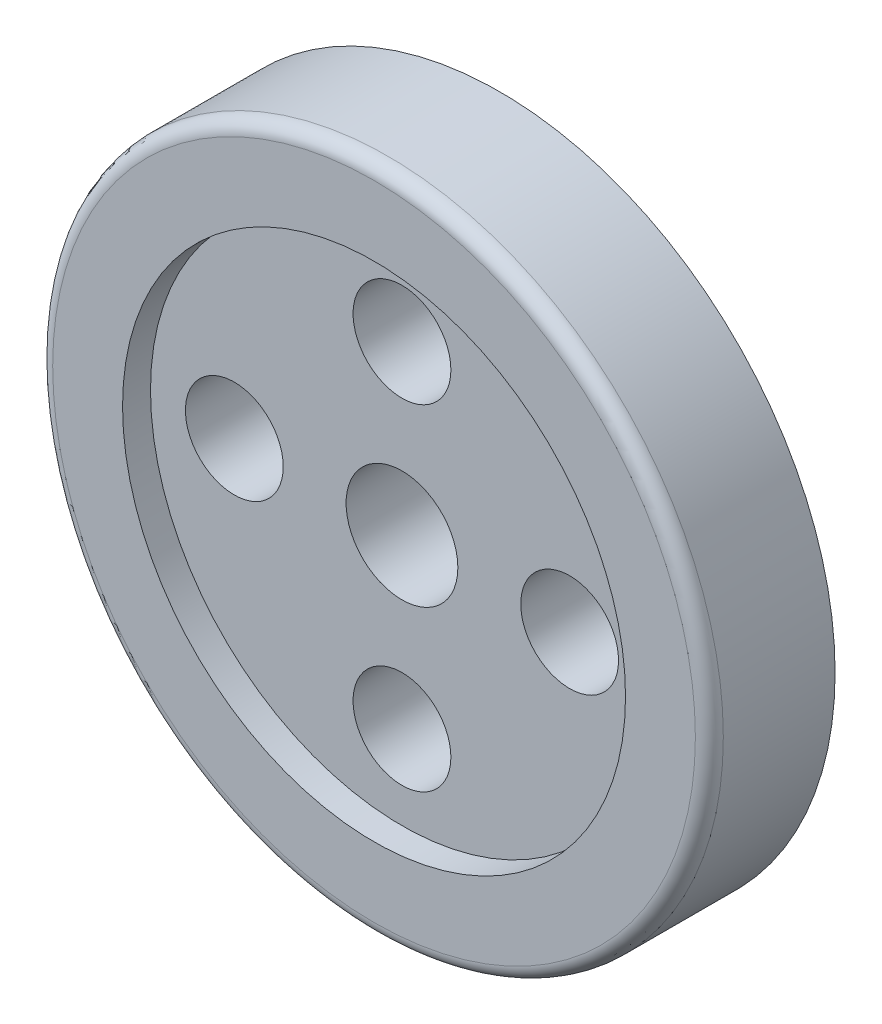
ISO-10303-21;
HEADER;
FILE_DESCRIPTION(('STEP AP214'),'2;1');
FILE_NAME('part.step','',(''),(''),'','','');
FILE_SCHEMA(('AUTOMOTIVE_DESIGN { 1 0 10303 214 1 1 1 1 }'));
ENDSEC;
DATA;
#1=APPLICATION_CONTEXT('core data for automotive mechanical design processes');
#2=APPLICATION_PROTOCOL_DEFINITION('international standard','automotive_design',2000,#1);
#3=PRODUCT_CONTEXT('',#1,'mechanical');
#4=PRODUCT('Part','Part','',(#3));
#5=PRODUCT_RELATED_PRODUCT_CATEGORY('part','',(#4));
#6=PRODUCT_DEFINITION_FORMATION('','',#4);
#7=PRODUCT_DEFINITION_CONTEXT('part definition',#1,'design');
#8=PRODUCT_DEFINITION('design','',#6,#7);
#9=PRODUCT_DEFINITION_SHAPE('','',#8);
#10=(LENGTH_UNIT() NAMED_UNIT(*) SI_UNIT(.MILLI.,.METRE.));
#11=(NAMED_UNIT(*) PLANE_ANGLE_UNIT() SI_UNIT($,.RADIAN.));
#12=(NAMED_UNIT(*) SI_UNIT($,.STERADIAN.) SOLID_ANGLE_UNIT());
#13=UNCERTAINTY_MEASURE_WITH_UNIT(LENGTH_MEASURE(1.E-05),#10,'distance_accuracy_value','');
#14=(GEOMETRIC_REPRESENTATION_CONTEXT(3) GLOBAL_UNCERTAINTY_ASSIGNED_CONTEXT((#13)) GLOBAL_UNIT_ASSIGNED_CONTEXT((#10,
#11,#12)) REPRESENTATION_CONTEXT('',''));
#15=CARTESIAN_POINT('',(0.,0.,0.));
#16=DIRECTION('',(0.,0.,1.));
#17=DIRECTION('',(1.,0.,0.));
#18=AXIS2_PLACEMENT_3D('',#15,#16,#17);
#19=CARTESIAN_POINT('',(0.,0.,4.5));
#20=DIRECTION('',(0.,0.,-1.));
#21=DIRECTION('',(-1.,0.,0.));
#22=AXIS2_PLACEMENT_3D('',#19,#20,#21);
#23=CYLINDRICAL_SURFACE('',#22,18.);
#24=CARTESIAN_POINT('',(0.,0.,2.5));
#25=DIRECTION('',(0.,0.,1.));
#26=DIRECTION('',(1.,0.,0.));
#27=AXIS2_PLACEMENT_3D('',#24,#25,#26);
#28=CIRCLE('',#27,18.);
#29=CARTESIAN_POINT('',(18.,0.,2.5));
#30=VERTEX_POINT('',#29);
#31=EDGE_CURVE('E43',#30,#30,#28,.T.);
#32=ORIENTED_EDGE('',*,*,#31,.F.);
#33=EDGE_LOOP('',(#32));
#34=FACE_BOUND('',#33,.T.);
#35=CARTESIAN_POINT('',(0.,0.,4.5));
#36=DIRECTION('',(0.,0.,1.));
#37=DIRECTION('',(1.,0.,0.));
#38=AXIS2_PLACEMENT_3D('',#35,#36,#37);
#39=CIRCLE('',#38,18.);
#40=CARTESIAN_POINT('',(18.,0.,4.5));
#41=VERTEX_POINT('',#40);
#42=EDGE_CURVE('E47',#41,#41,#39,.T.);
#43=ORIENTED_EDGE('',*,*,#42,.T.);
#44=EDGE_LOOP('',(#43));
#45=FACE_BOUND('',#44,.T.);
#46=ADVANCED_FACE('F32',(#34,#45),#23,.F.);
#47=CARTESIAN_POINT('',(0.,0.,4.5));
#48=DIRECTION('',(0.,0.,-1.));
#49=DIRECTION('',(-1.,0.,0.));
#50=AXIS2_PLACEMENT_3D('',#47,#48,#49);
#51=CYLINDRICAL_SURFACE('',#50,24.);
#52=CARTESIAN_POINT('',(0.,0.,3.5));
#53=DIRECTION('',(0.,0.,1.));
#54=DIRECTION('',(1.,0.,0.));
#55=AXIS2_PLACEMENT_3D('',#52,#53,#54);
#56=CIRCLE('',#55,24.);
#57=CARTESIAN_POINT('',(24.,0.,3.5));
#58=VERTEX_POINT('',#57);
#59=EDGE_CURVE('E10',#58,#58,#56,.F.);
#60=ORIENTED_EDGE('',*,*,#59,.T.);
#61=EDGE_LOOP('',(#60));
#62=FACE_BOUND('',#61,.T.);
#63=CARTESIAN_POINT('',(0.,0.,-4.5));
#64=DIRECTION('',(0.,0.,1.));
#65=DIRECTION('',(1.,0.,0.));
#66=AXIS2_PLACEMENT_3D('',#63,#64,#65);
#67=CIRCLE('',#66,24.);
#68=CARTESIAN_POINT('',(24.,0.,-4.5));
#69=VERTEX_POINT('',#68);
#70=EDGE_CURVE('E50',#69,#69,#67,.T.);
#71=ORIENTED_EDGE('',*,*,#70,.T.);
#72=EDGE_LOOP('',(#71));
#73=FACE_BOUND('',#72,.T.);
#74=ADVANCED_FACE('F118',(#62,#73),#51,.T.);
#75=CARTESIAN_POINT('',(0.,0.,4.5));
#76=DIRECTION('',(0.,0.,1.));
#77=DIRECTION('',(1.,0.,0.));
#78=AXIS2_PLACEMENT_3D('',#75,#76,#77);
#79=PLANE('',#78);
#80=CARTESIAN_POINT('',(0.,0.,4.5));
#81=DIRECTION('',(0.,0.,1.));
#82=DIRECTION('',(1.,0.,0.));
#83=AXIS2_PLACEMENT_3D('',#80,#81,#82);
#84=CIRCLE('',#83,23.);
#85=CARTESIAN_POINT('',(23.,0.,4.5));
#86=VERTEX_POINT('',#85);
#87=EDGE_CURVE('E39',#86,#86,#84,.T.);
#88=ORIENTED_EDGE('',*,*,#87,.T.);
#89=EDGE_LOOP('',(#88));
#90=FACE_BOUND('',#89,.T.);
#91=ORIENTED_EDGE('',*,*,#42,.F.);
#92=EDGE_LOOP('',(#91));
#93=FACE_BOUND('',#92,.T.);
#94=ADVANCED_FACE('F123',(#90,#93),#79,.T.);
#95=CARTESIAN_POINT('',(0.,0.,-4.5));
#96=DIRECTION('',(0.,0.,1.));
#97=DIRECTION('',(1.,0.,0.));
#98=AXIS2_PLACEMENT_3D('',#95,#96,#97);
#99=PLANE('',#98);
#100=ORIENTED_EDGE('',*,*,#70,.F.);
#101=EDGE_LOOP('',(#100));
#102=FACE_BOUND('',#101,.T.);
#103=CARTESIAN_POINT('',(12.,0.,-4.5));
#104=DIRECTION('',(0.,0.,1.));
#105=DIRECTION('',(1.,0.,0.));
#106=AXIS2_PLACEMENT_3D('',#103,#104,#105);
#107=CIRCLE('',#106,3.5);
#108=CARTESIAN_POINT('',(15.5,0.,-4.5));
#109=VERTEX_POINT('',#108);
#110=EDGE_CURVE('E59',#109,#109,#107,.T.);
#111=ORIENTED_EDGE('',*,*,#110,.T.);
#112=EDGE_LOOP('',(#111));
#113=FACE_BOUND('',#112,.T.);
#114=CARTESIAN_POINT('',(0.,-12.,-4.5));
#115=DIRECTION('',(0.,0.,1.));
#116=DIRECTION('',(1.,0.,0.));
#117=AXIS2_PLACEMENT_3D('',#114,#115,#116);
#118=CIRCLE('',#117,3.5);
#119=CARTESIAN_POINT('',(3.5,-12.,-4.5));
#120=VERTEX_POINT('',#119);
#121=EDGE_CURVE('E80',#120,#120,#118,.T.);
#122=ORIENTED_EDGE('',*,*,#121,.T.);
#123=EDGE_LOOP('',(#122));
#124=FACE_BOUND('',#123,.T.);
#125=CARTESIAN_POINT('',(-12.,0.,-4.5));
#126=DIRECTION('',(0.,0.,1.));
#127=DIRECTION('',(1.,0.,0.));
#128=AXIS2_PLACEMENT_3D('',#125,#126,#127);
#129=CIRCLE('',#128,3.5);
#130=CARTESIAN_POINT('',(-8.5,0.,-4.5));
#131=VERTEX_POINT('',#130);
#132=EDGE_CURVE('E77',#131,#131,#129,.T.);
#133=ORIENTED_EDGE('',*,*,#132,.T.);
#134=EDGE_LOOP('',(#133));
#135=FACE_BOUND('',#134,.T.);
#136=CARTESIAN_POINT('',(0.,12.,-4.5));
#137=DIRECTION('',(0.,0.,1.));
#138=DIRECTION('',(1.,0.,0.));
#139=AXIS2_PLACEMENT_3D('',#136,#137,#138);
#140=CIRCLE('',#139,3.5);
#141=CARTESIAN_POINT('',(3.5,12.,-4.5));
#142=VERTEX_POINT('',#141);
#143=EDGE_CURVE('E74',#142,#142,#140,.T.);
#144=ORIENTED_EDGE('',*,*,#143,.T.);
#145=EDGE_LOOP('',(#144));
#146=FACE_BOUND('',#145,.T.);
#147=CARTESIAN_POINT('',(0.,0.,-4.5));
#148=DIRECTION('',(0.,0.,1.));
#149=DIRECTION('',(1.,0.,0.));
#150=AXIS2_PLACEMENT_3D('',#147,#148,#149);
#151=CIRCLE('',#150,4.);
#152=CARTESIAN_POINT('',(4.,0.,-4.5));
#153=VERTEX_POINT('',#152);
#154=EDGE_CURVE('E53',#153,#153,#151,.T.);
#155=ORIENTED_EDGE('',*,*,#154,.T.);
#156=EDGE_LOOP('',(#155));
#157=FACE_BOUND('',#156,.T.);
#158=ADVANCED_FACE('F86',(#102,#113,#124,#135,#146,#157),#99,.F.);
#159=CARTESIAN_POINT('',(0.,12.,-4.5));
#160=DIRECTION('',(0.,0.,1.));
#161=DIRECTION('',(1.,0.,0.));
#162=AXIS2_PLACEMENT_3D('',#159,#160,#161);
#163=CYLINDRICAL_SURFACE('',#162,3.5);
#164=ORIENTED_EDGE('',*,*,#143,.F.);
#165=EDGE_LOOP('',(#164));
#166=FACE_BOUND('',#165,.T.);
#167=CARTESIAN_POINT('',(0.,12.,2.5));
#168=DIRECTION('',(0.,0.,1.));
#169=DIRECTION('',(1.,0.,0.));
#170=AXIS2_PLACEMENT_3D('',#167,#168,#169);
#171=CIRCLE('',#170,3.5);
#172=CARTESIAN_POINT('',(3.5,12.,2.5));
#173=VERTEX_POINT('',#172);
#174=EDGE_CURVE('E60',#173,#173,#171,.T.);
#175=ORIENTED_EDGE('',*,*,#174,.T.);
#176=EDGE_LOOP('',(#175));
#177=FACE_BOUND('',#176,.T.);
#178=ADVANCED_FACE('F130',(#166,#177),#163,.F.);
#179=CARTESIAN_POINT('',(-12.,0.,-4.5));
#180=DIRECTION('',(0.,0.,1.));
#181=DIRECTION('',(1.,0.,0.));
#182=AXIS2_PLACEMENT_3D('',#179,#180,#181);
#183=CYLINDRICAL_SURFACE('',#182,3.5);
#184=ORIENTED_EDGE('',*,*,#132,.F.);
#185=EDGE_LOOP('',(#184));
#186=FACE_BOUND('',#185,.T.);
#187=CARTESIAN_POINT('',(-12.,0.,2.5));
#188=DIRECTION('',(0.,0.,1.));
#189=DIRECTION('',(1.,0.,0.));
#190=AXIS2_PLACEMENT_3D('',#187,#188,#189);
#191=CIRCLE('',#190,3.5);
#192=CARTESIAN_POINT('',(-8.5,0.,2.5));
#193=VERTEX_POINT('',#192);
#194=EDGE_CURVE('E63',#193,#193,#191,.T.);
#195=ORIENTED_EDGE('',*,*,#194,.T.);
#196=EDGE_LOOP('',(#195));
#197=FACE_BOUND('',#196,.T.);
#198=ADVANCED_FACE('F136',(#186,#197),#183,.F.);
#199=CARTESIAN_POINT('',(0.,-12.,-4.5));
#200=DIRECTION('',(0.,0.,1.));
#201=DIRECTION('',(1.,0.,0.));
#202=AXIS2_PLACEMENT_3D('',#199,#200,#201);
#203=CYLINDRICAL_SURFACE('',#202,3.5);
#204=ORIENTED_EDGE('',*,*,#121,.F.);
#205=EDGE_LOOP('',(#204));
#206=FACE_BOUND('',#205,.T.);
#207=CARTESIAN_POINT('',(0.,-12.,2.5));
#208=DIRECTION('',(0.,0.,1.));
#209=DIRECTION('',(1.,0.,0.));
#210=AXIS2_PLACEMENT_3D('',#207,#208,#209);
#211=CIRCLE('',#210,3.5);
#212=CARTESIAN_POINT('',(3.5,-12.,2.5));
#213=VERTEX_POINT('',#212);
#214=EDGE_CURVE('E66',#213,#213,#211,.T.);
#215=ORIENTED_EDGE('',*,*,#214,.T.);
#216=EDGE_LOOP('',(#215));
#217=FACE_BOUND('',#216,.T.);
#218=ADVANCED_FACE('F93',(#206,#217),#203,.F.);
#219=CARTESIAN_POINT('',(12.,0.,-4.5));
#220=DIRECTION('',(0.,0.,1.));
#221=DIRECTION('',(1.,0.,0.));
#222=AXIS2_PLACEMENT_3D('',#219,#220,#221);
#223=CYLINDRICAL_SURFACE('',#222,3.5);
#224=ORIENTED_EDGE('',*,*,#110,.F.);
#225=EDGE_LOOP('',(#224));
#226=FACE_BOUND('',#225,.T.);
#227=CARTESIAN_POINT('',(12.,0.,2.5));
#228=DIRECTION('',(0.,0.,1.));
#229=DIRECTION('',(1.,0.,0.));
#230=AXIS2_PLACEMENT_3D('',#227,#228,#229);
#231=CIRCLE('',#230,3.5);
#232=CARTESIAN_POINT('',(15.5,0.,2.5));
#233=VERTEX_POINT('',#232);
#234=EDGE_CURVE('E69',#233,#233,#231,.T.);
#235=ORIENTED_EDGE('',*,*,#234,.T.);
#236=EDGE_LOOP('',(#235));
#237=FACE_BOUND('',#236,.T.);
#238=ADVANCED_FACE('F89',(#226,#237),#223,.F.);
#239=CARTESIAN_POINT('',(0.,0.,-4.5));
#240=DIRECTION('',(0.,0.,1.));
#241=DIRECTION('',(1.,0.,0.));
#242=AXIS2_PLACEMENT_3D('',#239,#240,#241);
#243=CYLINDRICAL_SURFACE('',#242,4.);
#244=ORIENTED_EDGE('',*,*,#154,.F.);
#245=EDGE_LOOP('',(#244));
#246=FACE_BOUND('',#245,.T.);
#247=CARTESIAN_POINT('',(0.,0.,2.5));
#248=DIRECTION('',(0.,0.,1.));
#249=DIRECTION('',(1.,0.,0.));
#250=AXIS2_PLACEMENT_3D('',#247,#248,#249);
#251=CIRCLE('',#250,4.);
#252=CARTESIAN_POINT('',(4.,0.,2.5));
#253=VERTEX_POINT('',#252);
#254=EDGE_CURVE('E56',#253,#253,#251,.T.);
#255=ORIENTED_EDGE('',*,*,#254,.T.);
#256=EDGE_LOOP('',(#255));
#257=FACE_BOUND('',#256,.T.);
#258=ADVANCED_FACE('F92',(#246,#257),#243,.F.);
#259=CARTESIAN_POINT('',(0.,0.,2.5));
#260=DIRECTION('',(0.,0.,1.));
#261=DIRECTION('',(1.,0.,0.));
#262=AXIS2_PLACEMENT_3D('',#259,#260,#261);
#263=PLANE('',#262);
#264=ORIENTED_EDGE('',*,*,#31,.T.);
#265=EDGE_LOOP('',(#264));
#266=FACE_BOUND('',#265,.T.);
#267=ORIENTED_EDGE('',*,*,#234,.F.);
#268=EDGE_LOOP('',(#267));
#269=FACE_BOUND('',#268,.T.);
#270=ORIENTED_EDGE('',*,*,#214,.F.);
#271=EDGE_LOOP('',(#270));
#272=FACE_BOUND('',#271,.T.);
#273=ORIENTED_EDGE('',*,*,#194,.F.);
#274=EDGE_LOOP('',(#273));
#275=FACE_BOUND('',#274,.T.);
#276=ORIENTED_EDGE('',*,*,#174,.F.);
#277=EDGE_LOOP('',(#276));
#278=FACE_BOUND('',#277,.T.);
#279=ORIENTED_EDGE('',*,*,#254,.F.);
#280=EDGE_LOOP('',(#279));
#281=FACE_BOUND('',#280,.T.);
#282=ADVANCED_FACE('F97',(#266,#269,#272,#275,#278,#281),#263,.T.);
#283=CARTESIAN_POINT('',(0.,0.,3.5));
#284=DIRECTION('',(0.,0.,1.));
#285=DIRECTION('',(1.,0.,0.));
#286=AXIS2_PLACEMENT_3D('',#283,#284,#285);
#287=TOROIDAL_SURFACE('',#286,23.,1.);
#288=ORIENTED_EDGE('',*,*,#59,.F.);
#289=EDGE_LOOP('',(#288));
#290=FACE_BOUND('',#289,.T.);
#291=ORIENTED_EDGE('',*,*,#87,.F.);
#292=EDGE_LOOP('',(#291));
#293=FACE_BOUND('',#292,.T.);
#294=ADVANCED_FACE('F34',(#290,#293),#287,.T.);
#295=CLOSED_SHELL('',(#46,#74,#94,#158,#178,#198,#218,#238,#258,#282,#294));
#296=MANIFOLD_SOLID_BREP('B2',#295);
#297=ADVANCED_BREP_SHAPE_REPRESENTATION('',(#18,#296),#14);
#298=SHAPE_DEFINITION_REPRESENTATION(#9,#297);
ENDSEC;
END-ISO-10303-21;
